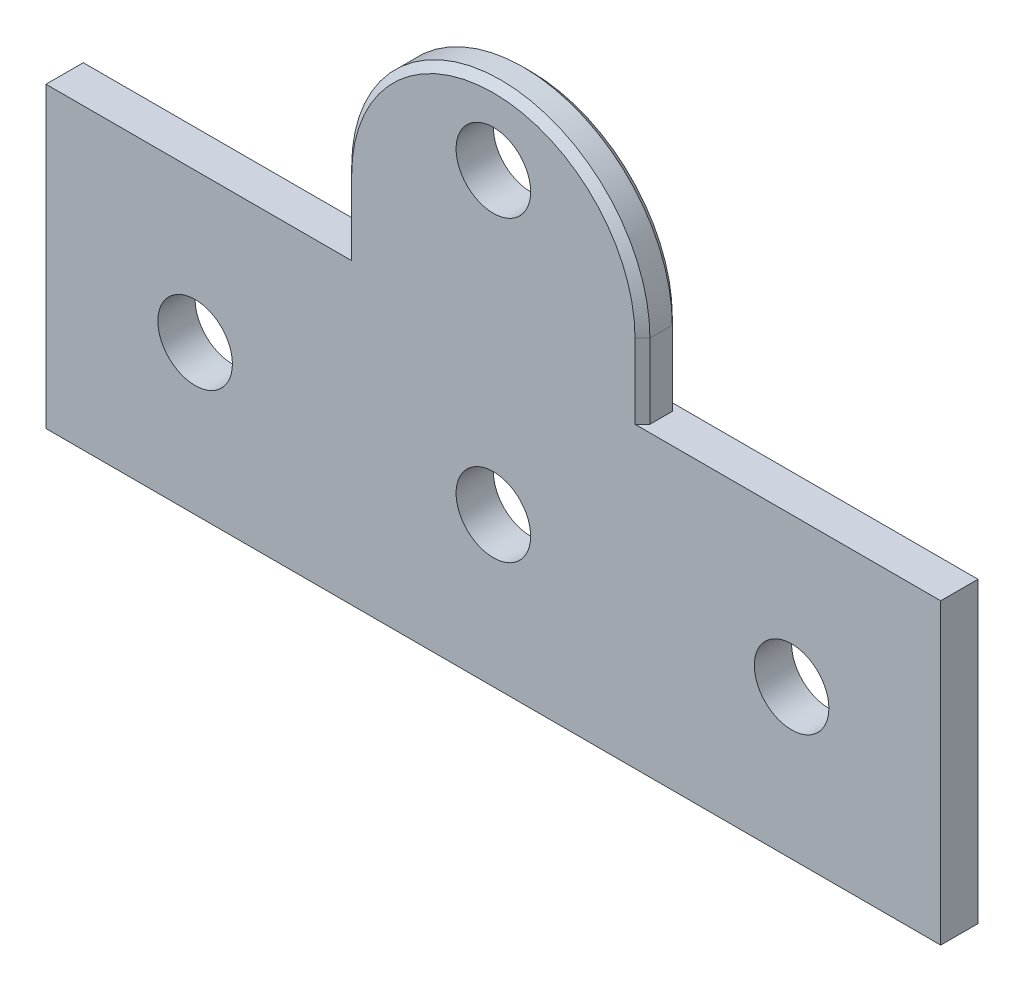
ISO-10303-21;
HEADER;
FILE_DESCRIPTION(('STEP AP214'),'2;1');
FILE_NAME('part.step','',(''),(''),'','','');
FILE_SCHEMA(('AUTOMOTIVE_DESIGN { 1 0 10303 214 1 1 1 1 }'));
ENDSEC;
DATA;
#1=APPLICATION_CONTEXT('core data for automotive mechanical design processes');
#2=APPLICATION_PROTOCOL_DEFINITION('international standard','automotive_design',2000,#1);
#3=PRODUCT_CONTEXT('',#1,'mechanical');
#4=PRODUCT('Part','Part','',(#3));
#5=PRODUCT_RELATED_PRODUCT_CATEGORY('part','',(#4));
#6=PRODUCT_DEFINITION_FORMATION('','',#4);
#7=PRODUCT_DEFINITION_CONTEXT('part definition',#1,'design');
#8=PRODUCT_DEFINITION('design','',#6,#7);
#9=PRODUCT_DEFINITION_SHAPE('','',#8);
#10=(LENGTH_UNIT() NAMED_UNIT(*) SI_UNIT(.MILLI.,.METRE.));
#11=(NAMED_UNIT(*) PLANE_ANGLE_UNIT() SI_UNIT($,.RADIAN.));
#12=(NAMED_UNIT(*) SI_UNIT($,.STERADIAN.) SOLID_ANGLE_UNIT());
#13=UNCERTAINTY_MEASURE_WITH_UNIT(LENGTH_MEASURE(1.E-05),#10,'distance_accuracy_value','');
#14=(GEOMETRIC_REPRESENTATION_CONTEXT(3) GLOBAL_UNCERTAINTY_ASSIGNED_CONTEXT((#13)) GLOBAL_UNIT_ASSIGNED_CONTEXT((#10,
#11,#12)) REPRESENTATION_CONTEXT('',''));
#15=CARTESIAN_POINT('',(0.,0.,0.));
#16=DIRECTION('',(0.,0.,1.));
#17=DIRECTION('',(1.,0.,0.));
#18=AXIS2_PLACEMENT_3D('',#15,#16,#17);
#19=CARTESIAN_POINT('',(12.7,31.75,3.175));
#20=DIRECTION('',(0.,0.,-1.));
#21=DIRECTION('',(-1.,0.,0.));
#22=AXIS2_PLACEMENT_3D('',#19,#20,#21);
#23=PLANE('',#22);
#24=DIRECTION('',(-1.,0.,0.));
#25=VECTOR('',#24,1.);
#26=CARTESIAN_POINT('',(50.8,25.4,3.175));
#27=LINE('',#26,#25);
#28=CARTESIAN_POINT('',(50.8,25.4,3.175));
#29=VERTEX_POINT('',#28);
#30=CARTESIAN_POINT('',(24.765,25.4,3.175));
#31=VERTEX_POINT('',#30);
#32=EDGE_CURVE('E50',#29,#31,#27,.T.);
#33=ORIENTED_EDGE('',*,*,#32,.T.);
#34=DIRECTION('',(0.,1.,0.));
#35=VECTOR('',#34,1.);
#36=CARTESIAN_POINT('',(24.765,31.75,3.175));
#37=LINE('',#36,#35);
#38=CARTESIAN_POINT('',(24.765,31.75,3.175));
#39=VERTEX_POINT('',#38);
#40=EDGE_CURVE('E203',#31,#39,#37,.T.);
#41=ORIENTED_EDGE('',*,*,#40,.T.);
#42=CARTESIAN_POINT('',(12.7,31.75,3.175));
#43=DIRECTION('',(0.,0.,-1.));
#44=DIRECTION('',(-1.,0.,0.));
#45=AXIS2_PLACEMENT_3D('',#42,#43,#44);
#46=CIRCLE('',#45,12.065);
#47=CARTESIAN_POINT('',(0.635000000000018,31.75,3.175));
#48=VERTEX_POINT('',#47);
#49=EDGE_CURVE('E199',#39,#48,#46,.F.);
#50=ORIENTED_EDGE('',*,*,#49,.T.);
#51=DIRECTION('',(0.,-1.,0.));
#52=VECTOR('',#51,1.);
#53=CARTESIAN_POINT('',(0.635000000000018,31.75,3.175));
#54=LINE('',#53,#52);
#55=CARTESIAN_POINT('',(0.635000000000018,25.4,3.175));
#56=VERTEX_POINT('',#55);
#57=EDGE_CURVE('E201',#48,#56,#54,.T.);
#58=ORIENTED_EDGE('',*,*,#57,.T.);
#59=DIRECTION('',(-1.,0.,0.));
#60=VECTOR('',#59,1.);
#61=CARTESIAN_POINT('',(0.,25.4,3.175));
#62=LINE('',#61,#60);
#63=CARTESIAN_POINT('',(-25.4,25.4,3.175));
#64=VERTEX_POINT('',#63);
#65=EDGE_CURVE('E57',#56,#64,#62,.T.);
#66=ORIENTED_EDGE('',*,*,#65,.T.);
#67=DIRECTION('',(0.,-1.,0.));
#68=VECTOR('',#67,1.);
#69=CARTESIAN_POINT('',(-25.4,25.4,3.175));
#70=LINE('',#69,#68);
#71=CARTESIAN_POINT('',(-25.4,0.,3.175));
#72=VERTEX_POINT('',#71);
#73=EDGE_CURVE('E129',#64,#72,#70,.T.);
#74=ORIENTED_EDGE('',*,*,#73,.T.);
#75=DIRECTION('',(1.,0.,0.));
#76=VECTOR('',#75,1.);
#77=CARTESIAN_POINT('',(-25.4,0.,3.175));
#78=LINE('',#77,#76);
#79=CARTESIAN_POINT('',(50.8,0.,3.175));
#80=VERTEX_POINT('',#79);
#81=EDGE_CURVE('E122',#72,#80,#78,.T.);
#82=ORIENTED_EDGE('',*,*,#81,.T.);
#83=DIRECTION('',(0.,1.,0.));
#84=VECTOR('',#83,1.);
#85=CARTESIAN_POINT('',(50.8,0.,3.175));
#86=LINE('',#85,#84);
#87=EDGE_CURVE('E126',#80,#29,#86,.T.);
#88=ORIENTED_EDGE('',*,*,#87,.T.);
#89=EDGE_LOOP('',(#33,#41,#50,#58,#66,#74,#82,#88));
#90=FACE_BOUND('',#89,.T.);
#91=CARTESIAN_POINT('',(12.7,38.1,3.175));
#92=DIRECTION('',(0.,0.,1.));
#93=DIRECTION('',(1.,0.,0.));
#94=AXIS2_PLACEMENT_3D('',#91,#92,#93);
#95=CIRCLE('',#94,3.175);
#96=CARTESIAN_POINT('',(15.875,38.1,3.175));
#97=VERTEX_POINT('',#96);
#98=EDGE_CURVE('E155',#97,#97,#95,.T.);
#99=ORIENTED_EDGE('',*,*,#98,.F.);
#100=EDGE_LOOP('',(#99));
#101=FACE_BOUND('',#100,.T.);
#102=CARTESIAN_POINT('',(12.7,12.7,3.175));
#103=DIRECTION('',(0.,0.,1.));
#104=DIRECTION('',(1.,0.,0.));
#105=AXIS2_PLACEMENT_3D('',#102,#103,#104);
#106=CIRCLE('',#105,3.175);
#107=CARTESIAN_POINT('',(15.875,12.7,3.175));
#108=VERTEX_POINT('',#107);
#109=EDGE_CURVE('E290',#108,#108,#106,.T.);
#110=ORIENTED_EDGE('',*,*,#109,.F.);
#111=EDGE_LOOP('',(#110));
#112=FACE_BOUND('',#111,.T.);
#113=CARTESIAN_POINT('',(38.1,12.7,3.175));
#114=DIRECTION('',(0.,0.,1.));
#115=DIRECTION('',(1.,0.,0.));
#116=AXIS2_PLACEMENT_3D('',#113,#114,#115);
#117=CIRCLE('',#116,3.175);
#118=CARTESIAN_POINT('',(41.275,12.7,3.175));
#119=VERTEX_POINT('',#118);
#120=EDGE_CURVE('E285',#119,#119,#117,.T.);
#121=ORIENTED_EDGE('',*,*,#120,.F.);
#122=EDGE_LOOP('',(#121));
#123=FACE_BOUND('',#122,.T.);
#124=CARTESIAN_POINT('',(-12.7,12.7,3.175));
#125=DIRECTION('',(0.,0.,1.));
#126=DIRECTION('',(1.,0.,0.));
#127=AXIS2_PLACEMENT_3D('',#124,#125,#126);
#128=CIRCLE('',#127,3.175);
#129=CARTESIAN_POINT('',(-9.525,12.7,3.175));
#130=VERTEX_POINT('',#129);
#131=EDGE_CURVE('E279',#130,#130,#128,.T.);
#132=ORIENTED_EDGE('',*,*,#131,.F.);
#133=EDGE_LOOP('',(#132));
#134=FACE_BOUND('',#133,.T.);
#135=ADVANCED_FACE('F33',(#90,#101,#112,#123,#134),#23,.F.);
#136=CARTESIAN_POINT('',(12.7,31.75,0.));
#137=DIRECTION('',(0.,0.,-1.));
#138=DIRECTION('',(-1.,0.,0.));
#139=AXIS2_PLACEMENT_3D('',#136,#137,#138);
#140=PLANE('',#139);
#141=CARTESIAN_POINT('',(38.1,12.7,0.));
#142=DIRECTION('',(0.,0.,1.));
#143=DIRECTION('',(1.,0.,0.));
#144=AXIS2_PLACEMENT_3D('',#141,#142,#143);
#145=CIRCLE('',#144,3.175);
#146=CARTESIAN_POINT('',(41.275,12.7,0.));
#147=VERTEX_POINT('',#146);
#148=EDGE_CURVE('E282',#147,#147,#145,.T.);
#149=ORIENTED_EDGE('',*,*,#148,.T.);
#150=EDGE_LOOP('',(#149));
#151=FACE_BOUND('',#150,.T.);
#152=CARTESIAN_POINT('',(12.7,38.1,0.));
#153=DIRECTION('',(0.,0.,1.));
#154=DIRECTION('',(1.,0.,0.));
#155=AXIS2_PLACEMENT_3D('',#152,#153,#154);
#156=CIRCLE('',#155,3.175);
#157=CARTESIAN_POINT('',(15.875,38.1,0.));
#158=VERTEX_POINT('',#157);
#159=EDGE_CURVE('E293',#158,#158,#156,.T.);
#160=ORIENTED_EDGE('',*,*,#159,.T.);
#161=EDGE_LOOP('',(#160));
#162=FACE_BOUND('',#161,.T.);
#163=DIRECTION('',(0.,-1.,0.));
#164=VECTOR('',#163,1.);
#165=CARTESIAN_POINT('',(24.765,25.4,0.));
#166=LINE('',#165,#164);
#167=CARTESIAN_POINT('',(24.765,31.75,0.));
#168=VERTEX_POINT('',#167);
#169=CARTESIAN_POINT('',(24.765,25.4,0.));
#170=VERTEX_POINT('',#169);
#171=EDGE_CURVE('E188',#168,#170,#166,.T.);
#172=ORIENTED_EDGE('',*,*,#171,.T.);
#173=DIRECTION('',(-1.,0.,0.));
#174=VECTOR('',#173,1.);
#175=CARTESIAN_POINT('',(50.8,25.4,0.));
#176=LINE('',#175,#174);
#177=CARTESIAN_POINT('',(50.8,25.4,0.));
#178=VERTEX_POINT('',#177);
#179=EDGE_CURVE('E157',#178,#170,#176,.T.);
#180=ORIENTED_EDGE('',*,*,#179,.F.);
#181=DIRECTION('',(0.,1.,0.));
#182=VECTOR('',#181,1.);
#183=CARTESIAN_POINT('',(50.8,0.,0.));
#184=LINE('',#183,#182);
#185=CARTESIAN_POINT('',(50.8,0.,0.));
#186=VERTEX_POINT('',#185);
#187=EDGE_CURVE('E154',#186,#178,#184,.T.);
#188=ORIENTED_EDGE('',*,*,#187,.F.);
#189=DIRECTION('',(1.,0.,0.));
#190=VECTOR('',#189,1.);
#191=CARTESIAN_POINT('',(25.4,0.,0.));
#192=LINE('',#191,#190);
#193=CARTESIAN_POINT('',(-25.4,0.,0.));
#194=VERTEX_POINT('',#193);
#195=EDGE_CURVE('E138',#194,#186,#192,.T.);
#196=ORIENTED_EDGE('',*,*,#195,.F.);
#197=DIRECTION('',(0.,-1.,0.));
#198=VECTOR('',#197,1.);
#199=CARTESIAN_POINT('',(-25.4,25.4,0.));
#200=LINE('',#199,#198);
#201=CARTESIAN_POINT('',(-25.4,25.4,0.));
#202=VERTEX_POINT('',#201);
#203=EDGE_CURVE('E133',#202,#194,#200,.T.);
#204=ORIENTED_EDGE('',*,*,#203,.F.);
#205=DIRECTION('',(-1.,0.,0.));
#206=VECTOR('',#205,1.);
#207=CARTESIAN_POINT('',(0.,25.4,0.));
#208=LINE('',#207,#206);
#209=CARTESIAN_POINT('',(0.635000000000004,25.4,0.));
#210=VERTEX_POINT('',#209);
#211=EDGE_CURVE('E159',#210,#202,#208,.T.);
#212=ORIENTED_EDGE('',*,*,#211,.F.);
#213=DIRECTION('',(0.,1.,0.));
#214=VECTOR('',#213,1.);
#215=CARTESIAN_POINT('',(0.635000000000004,31.75,0.));
#216=LINE('',#215,#214);
#217=CARTESIAN_POINT('',(0.635000000000004,31.75,0.));
#218=VERTEX_POINT('',#217);
#219=EDGE_CURVE('E186',#210,#218,#216,.T.);
#220=ORIENTED_EDGE('',*,*,#219,.T.);
#221=CARTESIAN_POINT('',(12.7,31.75,0.));
#222=DIRECTION('',(0.,0.,-1.));
#223=DIRECTION('',(-1.,0.,0.));
#224=AXIS2_PLACEMENT_3D('',#221,#222,#223);
#225=CIRCLE('',#224,12.065);
#226=EDGE_CURVE('E184',#218,#168,#225,.T.);
#227=ORIENTED_EDGE('',*,*,#226,.T.);
#228=EDGE_LOOP('',(#172,#180,#188,#196,#204,#212,#220,#227));
#229=FACE_BOUND('',#228,.T.);
#230=CARTESIAN_POINT('',(12.7,12.7,0.));
#231=DIRECTION('',(0.,0.,1.));
#232=DIRECTION('',(1.,0.,0.));
#233=AXIS2_PLACEMENT_3D('',#230,#231,#232);
#234=CIRCLE('',#233,3.175);
#235=CARTESIAN_POINT('',(15.875,12.7,0.));
#236=VERTEX_POINT('',#235);
#237=EDGE_CURVE('E275',#236,#236,#234,.T.);
#238=ORIENTED_EDGE('',*,*,#237,.T.);
#239=EDGE_LOOP('',(#238));
#240=FACE_BOUND('',#239,.T.);
#241=CARTESIAN_POINT('',(-12.7,12.7,0.));
#242=DIRECTION('',(0.,0.,1.));
#243=DIRECTION('',(1.,0.,0.));
#244=AXIS2_PLACEMENT_3D('',#241,#242,#243);
#245=CIRCLE('',#244,3.175);
#246=CARTESIAN_POINT('',(-9.525,12.7,0.));
#247=VERTEX_POINT('',#246);
#248=EDGE_CURVE('E215',#247,#247,#245,.T.);
#249=ORIENTED_EDGE('',*,*,#248,.T.);
#250=EDGE_LOOP('',(#249));
#251=FACE_BOUND('',#250,.T.);
#252=ADVANCED_FACE('F266',(#151,#162,#229,#240,#251),#140,.T.);
#253=CARTESIAN_POINT('',(25.4,0.,3.175));
#254=DIRECTION('',(0.,1.,0.));
#255=DIRECTION('',(0.,0.,1.));
#256=AXIS2_PLACEMENT_3D('',#253,#254,#255);
#257=PLANE('',#256);
#258=ORIENTED_EDGE('',*,*,#195,.T.);
#259=DIRECTION('',(0.,0.,-1.));
#260=VECTOR('',#259,1.);
#261=CARTESIAN_POINT('',(50.8,0.,3.175));
#262=LINE('',#261,#260);
#263=EDGE_CURVE('E136',#80,#186,#262,.T.);
#264=ORIENTED_EDGE('',*,*,#263,.F.);
#265=ORIENTED_EDGE('',*,*,#81,.F.);
#266=DIRECTION('',(0.,0.,-1.));
#267=VECTOR('',#266,1.);
#268=CARTESIAN_POINT('',(-25.4,0.,3.175));
#269=LINE('',#268,#267);
#270=EDGE_CURVE('E152',#72,#194,#269,.T.);
#271=ORIENTED_EDGE('',*,*,#270,.T.);
#272=EDGE_LOOP('',(#258,#264,#265,#271));
#273=FACE_BOUND('',#272,.T.);
#274=ADVANCED_FACE('F137',(#273),#257,.F.);
#275=CARTESIAN_POINT('',(50.8,0.,3.175));
#276=DIRECTION('',(-1.,0.,0.));
#277=DIRECTION('',(0.,0.,1.));
#278=AXIS2_PLACEMENT_3D('',#275,#276,#277);
#279=PLANE('',#278);
#280=ORIENTED_EDGE('',*,*,#187,.T.);
#281=DIRECTION('',(0.,0.,-1.));
#282=VECTOR('',#281,1.);
#283=CARTESIAN_POINT('',(50.8,25.4,3.175));
#284=LINE('',#283,#282);
#285=EDGE_CURVE('E142',#29,#178,#284,.T.);
#286=ORIENTED_EDGE('',*,*,#285,.F.);
#287=ORIENTED_EDGE('',*,*,#87,.F.);
#288=ORIENTED_EDGE('',*,*,#263,.T.);
#289=EDGE_LOOP('',(#280,#286,#287,#288));
#290=FACE_BOUND('',#289,.T.);
#291=ADVANCED_FACE('F144',(#290),#279,.F.);
#292=CARTESIAN_POINT('',(50.8,25.4,3.175));
#293=DIRECTION('',(0.,-1.,0.));
#294=DIRECTION('',(0.,0.,-1.));
#295=AXIS2_PLACEMENT_3D('',#292,#293,#294);
#296=PLANE('',#295);
#297=ORIENTED_EDGE('',*,*,#179,.T.);
#298=DIRECTION('',(0.707106781186549,0.,0.707106781186547));
#299=VECTOR('',#298,1.);
#300=CARTESIAN_POINT('',(39.37,25.4,14.605));
#301=LINE('',#300,#299);
#302=CARTESIAN_POINT('',(25.4,25.4,0.635000000000002));
#303=VERTEX_POINT('',#302);
#304=EDGE_CURVE('E205',#170,#303,#301,.T.);
#305=ORIENTED_EDGE('',*,*,#304,.T.);
#306=DIRECTION('',(0.,0.,-1.));
#307=VECTOR('',#306,1.);
#308=CARTESIAN_POINT('',(25.4,25.4,3.175));
#309=LINE('',#308,#307);
#310=CARTESIAN_POINT('',(25.4,25.4,2.54));
#311=VERTEX_POINT('',#310);
#312=EDGE_CURVE('E176',#311,#303,#309,.T.);
#313=ORIENTED_EDGE('',*,*,#312,.F.);
#314=DIRECTION('',(0.707106781186556,0.,-0.707106781186539));
#315=VECTOR('',#314,1.);
#316=CARTESIAN_POINT('',(37.7825000000003,25.4,-9.84250000000001));
#317=LINE('',#316,#315);
#318=EDGE_CURVE('E42',#311,#31,#317,.F.);
#319=ORIENTED_EDGE('',*,*,#318,.T.);
#320=ORIENTED_EDGE('',*,*,#32,.F.);
#321=ORIENTED_EDGE('',*,*,#285,.T.);
#322=EDGE_LOOP('',(#297,#305,#313,#319,#320,#321));
#323=FACE_BOUND('',#322,.T.);
#324=ADVANCED_FACE('F235',(#323),#296,.F.);
#325=CARTESIAN_POINT('',(25.4,31.75,3.175));
#326=DIRECTION('',(-1.,0.,0.));
#327=DIRECTION('',(0.,-1.,0.));
#328=AXIS2_PLACEMENT_3D('',#325,#326,#327);
#329=PLANE('',#328);
#330=ORIENTED_EDGE('',*,*,#312,.T.);
#331=DIRECTION('',(0.,1.,0.));
#332=VECTOR('',#331,1.);
#333=CARTESIAN_POINT('',(25.4,31.75,0.635000000000002));
#334=LINE('',#333,#332);
#335=CARTESIAN_POINT('',(25.4,31.75,0.635000000000002));
#336=VERTEX_POINT('',#335);
#337=EDGE_CURVE('E181',#303,#336,#334,.T.);
#338=ORIENTED_EDGE('',*,*,#337,.T.);
#339=DIRECTION('',(0.,0.,-1.));
#340=VECTOR('',#339,1.);
#341=CARTESIAN_POINT('',(25.4,31.75,3.175));
#342=LINE('',#341,#340);
#343=CARTESIAN_POINT('',(25.4,31.75,2.54));
#344=VERTEX_POINT('',#343);
#345=EDGE_CURVE('E173',#344,#336,#342,.T.);
#346=ORIENTED_EDGE('',*,*,#345,.F.);
#347=DIRECTION('',(0.,-1.,0.));
#348=VECTOR('',#347,1.);
#349=CARTESIAN_POINT('',(25.4,31.75,2.54));
#350=LINE('',#349,#348);
#351=EDGE_CURVE('E141',#344,#311,#350,.T.);
#352=ORIENTED_EDGE('',*,*,#351,.T.);
#353=EDGE_LOOP('',(#330,#338,#346,#352));
#354=FACE_BOUND('',#353,.T.);
#355=ADVANCED_FACE('F239',(#354),#329,.F.);
#356=CARTESIAN_POINT('',(12.7,31.75,3.175));
#357=DIRECTION('',(0.,0.,-1.));
#358=DIRECTION('',(-1.,0.,0.));
#359=AXIS2_PLACEMENT_3D('',#356,#357,#358);
#360=CYLINDRICAL_SURFACE('',#359,12.7);
#361=ORIENTED_EDGE('',*,*,#345,.T.);
#362=CARTESIAN_POINT('',(12.7,31.75,0.635000000000002));
#363=DIRECTION('',(0.,0.,-1.));
#364=DIRECTION('',(-1.,0.,0.));
#365=AXIS2_PLACEMENT_3D('',#362,#363,#364);
#366=CIRCLE('',#365,12.7);
#367=CARTESIAN_POINT('',(0.,31.75,0.635000000000002));
#368=VERTEX_POINT('',#367);
#369=EDGE_CURVE('E197',#336,#368,#366,.F.);
#370=ORIENTED_EDGE('',*,*,#369,.T.);
#371=DIRECTION('',(0.,0.,-1.));
#372=VECTOR('',#371,1.);
#373=CARTESIAN_POINT('',(0.,31.75,3.175));
#374=LINE('',#373,#372);
#375=CARTESIAN_POINT('',(0.,31.75,2.54));
#376=VERTEX_POINT('',#375);
#377=EDGE_CURVE('E170',#376,#368,#374,.T.);
#378=ORIENTED_EDGE('',*,*,#377,.F.);
#379=CARTESIAN_POINT('',(12.7,31.75,2.54));
#380=DIRECTION('',(0.,0.,-1.));
#381=DIRECTION('',(-1.,0.,0.));
#382=AXIS2_PLACEMENT_3D('',#379,#380,#381);
#383=CIRCLE('',#382,12.7);
#384=EDGE_CURVE('E195',#376,#344,#383,.T.);
#385=ORIENTED_EDGE('',*,*,#384,.T.);
#386=EDGE_LOOP('',(#361,#370,#378,#385));
#387=FACE_BOUND('',#386,.T.);
#388=ADVANCED_FACE('F252',(#387),#360,.T.);
#389=CARTESIAN_POINT('',(0.,25.4,3.175));
#390=DIRECTION('',(1.,0.,0.));
#391=DIRECTION('',(0.,0.,-1.));
#392=AXIS2_PLACEMENT_3D('',#389,#390,#391);
#393=PLANE('',#392);
#394=ORIENTED_EDGE('',*,*,#377,.T.);
#395=DIRECTION('',(0.,-1.,0.));
#396=VECTOR('',#395,1.);
#397=CARTESIAN_POINT('',(0.,25.4,0.635000000000002));
#398=LINE('',#397,#396);
#399=CARTESIAN_POINT('',(0.,25.4,0.635000000000002));
#400=VERTEX_POINT('',#399);
#401=EDGE_CURVE('E193',#368,#400,#398,.T.);
#402=ORIENTED_EDGE('',*,*,#401,.T.);
#403=DIRECTION('',(0.,0.,-1.));
#404=VECTOR('',#403,1.);
#405=CARTESIAN_POINT('',(0.,25.4,3.175));
#406=LINE('',#405,#404);
#407=CARTESIAN_POINT('',(0.,25.4,2.54));
#408=VERTEX_POINT('',#407);
#409=EDGE_CURVE('E167',#408,#400,#406,.T.);
#410=ORIENTED_EDGE('',*,*,#409,.F.);
#411=DIRECTION('',(0.,1.,0.));
#412=VECTOR('',#411,1.);
#413=CARTESIAN_POINT('',(0.,25.4,2.54));
#414=LINE('',#413,#412);
#415=EDGE_CURVE('E191',#408,#376,#414,.T.);
#416=ORIENTED_EDGE('',*,*,#415,.T.);
#417=EDGE_LOOP('',(#394,#402,#410,#416));
#418=FACE_BOUND('',#417,.T.);
#419=ADVANCED_FACE('F255',(#418),#393,.F.);
#420=CARTESIAN_POINT('',(0.,25.4,3.175));
#421=DIRECTION('',(0.,-1.,0.));
#422=DIRECTION('',(0.,0.,-1.));
#423=AXIS2_PLACEMENT_3D('',#420,#421,#422);
#424=PLANE('',#423);
#425=ORIENTED_EDGE('',*,*,#211,.T.);
#426=DIRECTION('',(0.,0.,-1.));
#427=VECTOR('',#426,1.);
#428=CARTESIAN_POINT('',(-25.4,25.4,3.175));
#429=LINE('',#428,#427);
#430=EDGE_CURVE('E164',#64,#202,#429,.T.);
#431=ORIENTED_EDGE('',*,*,#430,.F.);
#432=ORIENTED_EDGE('',*,*,#65,.F.);
#433=DIRECTION('',(0.707106781186556,0.,0.707106781186539));
#434=VECTOR('',#433,1.);
#435=CARTESIAN_POINT('',(0.317500000000001,25.4,2.85749999999999));
#436=LINE('',#435,#434);
#437=EDGE_CURVE('E11',#56,#408,#436,.F.);
#438=ORIENTED_EDGE('',*,*,#437,.T.);
#439=ORIENTED_EDGE('',*,*,#409,.T.);
#440=DIRECTION('',(0.707106781186549,0.,-0.707106781186547));
#441=VECTOR('',#440,1.);
#442=CARTESIAN_POINT('',(-1.27,25.4,1.905));
#443=LINE('',#442,#441);
#444=EDGE_CURVE('E207',#400,#210,#443,.T.);
#445=ORIENTED_EDGE('',*,*,#444,.T.);
#446=EDGE_LOOP('',(#425,#431,#432,#438,#439,#445));
#447=FACE_BOUND('',#446,.T.);
#448=ADVANCED_FACE('F261',(#447),#424,.F.);
#449=CARTESIAN_POINT('',(-25.4,25.4,3.175));
#450=DIRECTION('',(1.,0.,0.));
#451=DIRECTION('',(0.,0.,-1.));
#452=AXIS2_PLACEMENT_3D('',#449,#450,#451);
#453=PLANE('',#452);
#454=ORIENTED_EDGE('',*,*,#203,.T.);
#455=ORIENTED_EDGE('',*,*,#270,.F.);
#456=ORIENTED_EDGE('',*,*,#73,.F.);
#457=ORIENTED_EDGE('',*,*,#430,.T.);
#458=EDGE_LOOP('',(#454,#455,#456,#457));
#459=FACE_BOUND('',#458,.T.);
#460=ADVANCED_FACE('F265',(#459),#453,.F.);
#461=CARTESIAN_POINT('',(12.7,38.1,3.175));
#462=DIRECTION('',(0.,0.,-1.));
#463=DIRECTION('',(-1.,0.,0.));
#464=AXIS2_PLACEMENT_3D('',#461,#462,#463);
#465=CYLINDRICAL_SURFACE('',#464,3.175);
#466=ORIENTED_EDGE('',*,*,#98,.T.);
#467=EDGE_LOOP('',(#466));
#468=FACE_BOUND('',#467,.T.);
#469=ORIENTED_EDGE('',*,*,#159,.F.);
#470=EDGE_LOOP('',(#469));
#471=FACE_BOUND('',#470,.T.);
#472=ADVANCED_FACE('F300',(#468,#471),#465,.F.);
#473=CARTESIAN_POINT('',(12.7,12.7,3.175));
#474=DIRECTION('',(0.,0.,-1.));
#475=DIRECTION('',(-1.,0.,0.));
#476=AXIS2_PLACEMENT_3D('',#473,#474,#475);
#477=CYLINDRICAL_SURFACE('',#476,3.175);
#478=ORIENTED_EDGE('',*,*,#109,.T.);
#479=EDGE_LOOP('',(#478));
#480=FACE_BOUND('',#479,.T.);
#481=ORIENTED_EDGE('',*,*,#237,.F.);
#482=EDGE_LOOP('',(#481));
#483=FACE_BOUND('',#482,.T.);
#484=ADVANCED_FACE('F302',(#480,#483),#477,.F.);
#485=CARTESIAN_POINT('',(38.1,12.7,3.175));
#486=DIRECTION('',(0.,0.,-1.));
#487=DIRECTION('',(-1.,0.,0.));
#488=AXIS2_PLACEMENT_3D('',#485,#486,#487);
#489=CYLINDRICAL_SURFACE('',#488,3.175);
#490=ORIENTED_EDGE('',*,*,#120,.T.);
#491=EDGE_LOOP('',(#490));
#492=FACE_BOUND('',#491,.T.);
#493=ORIENTED_EDGE('',*,*,#148,.F.);
#494=EDGE_LOOP('',(#493));
#495=FACE_BOUND('',#494,.T.);
#496=ADVANCED_FACE('F309',(#492,#495),#489,.F.);
#497=CARTESIAN_POINT('',(-12.7,12.7,3.175));
#498=DIRECTION('',(0.,0.,-1.));
#499=DIRECTION('',(-1.,0.,0.));
#500=AXIS2_PLACEMENT_3D('',#497,#498,#499);
#501=CYLINDRICAL_SURFACE('',#500,3.175);
#502=ORIENTED_EDGE('',*,*,#131,.T.);
#503=EDGE_LOOP('',(#502));
#504=FACE_BOUND('',#503,.T.);
#505=ORIENTED_EDGE('',*,*,#248,.F.);
#506=EDGE_LOOP('',(#505));
#507=FACE_BOUND('',#506,.T.);
#508=ADVANCED_FACE('F338',(#504,#507),#501,.F.);
#509=CARTESIAN_POINT('',(0.,25.4,0.635000000000002));
#510=DIRECTION('',(-0.707106781186547,0.,-0.707106781186549));
#511=DIRECTION('',(0.,1.,0.));
#512=AXIS2_PLACEMENT_3D('',#509,#510,#511);
#513=PLANE('',#512);
#514=ORIENTED_EDGE('',*,*,#444,.F.);
#515=ORIENTED_EDGE('',*,*,#401,.F.);
#516=DIRECTION('',(-0.707106781186549,0.,0.707106781186547));
#517=VECTOR('',#516,1.);
#518=CARTESIAN_POINT('',(0.635000000000004,31.75,0.));
#519=LINE('',#518,#517);
#520=EDGE_CURVE('E213',#218,#368,#519,.T.);
#521=ORIENTED_EDGE('',*,*,#520,.F.);
#522=ORIENTED_EDGE('',*,*,#219,.F.);
#523=EDGE_LOOP('',(#514,#515,#521,#522));
#524=FACE_BOUND('',#523,.T.);
#525=ADVANCED_FACE('F259',(#524),#513,.T.);
#526=CARTESIAN_POINT('',(12.7,31.75,0.635000000000002));
#527=DIRECTION('',(0.,0.,1.));
#528=DIRECTION('',(1.,0.,0.));
#529=AXIS2_PLACEMENT_3D('',#526,#527,#528);
#530=CONICAL_SURFACE('',#529,12.7,0.78539816339745);
#531=ORIENTED_EDGE('',*,*,#520,.T.);
#532=ORIENTED_EDGE('',*,*,#369,.F.);
#533=DIRECTION('',(0.707106781186549,0.,0.707106781186547));
#534=VECTOR('',#533,1.);
#535=CARTESIAN_POINT('',(24.765,31.75,0.));
#536=LINE('',#535,#534);
#537=EDGE_CURVE('E211',#168,#336,#536,.T.);
#538=ORIENTED_EDGE('',*,*,#537,.F.);
#539=ORIENTED_EDGE('',*,*,#226,.F.);
#540=EDGE_LOOP('',(#531,#532,#538,#539));
#541=FACE_BOUND('',#540,.T.);
#542=ADVANCED_FACE('F248',(#541),#530,.T.);
#543=CARTESIAN_POINT('',(25.4,31.75,0.635000000000002));
#544=DIRECTION('',(0.707106781186547,0.,-0.707106781186549));
#545=DIRECTION('',(0.,-1.,0.));
#546=AXIS2_PLACEMENT_3D('',#543,#544,#545);
#547=PLANE('',#546);
#548=ORIENTED_EDGE('',*,*,#304,.F.);
#549=ORIENTED_EDGE('',*,*,#171,.F.);
#550=ORIENTED_EDGE('',*,*,#537,.T.);
#551=ORIENTED_EDGE('',*,*,#337,.F.);
#552=EDGE_LOOP('',(#548,#549,#550,#551));
#553=FACE_BOUND('',#552,.T.);
#554=ADVANCED_FACE('F242',(#553),#547,.T.);
#555=CARTESIAN_POINT('',(0.635000000000018,31.75,3.175));
#556=DIRECTION('',(0.707106781186539,0.,-0.707106781186556));
#557=DIRECTION('',(0.,-1.,0.));
#558=AXIS2_PLACEMENT_3D('',#555,#556,#557);
#559=PLANE('',#558);
#560=ORIENTED_EDGE('',*,*,#437,.F.);
#561=ORIENTED_EDGE('',*,*,#57,.F.);
#562=DIRECTION('',(0.707106781186556,0.,0.707106781186539));
#563=VECTOR('',#562,1.);
#564=CARTESIAN_POINT('',(0.,31.75,2.54));
#565=LINE('',#564,#563);
#566=EDGE_CURVE('E37',#376,#48,#565,.T.);
#567=ORIENTED_EDGE('',*,*,#566,.F.);
#568=ORIENTED_EDGE('',*,*,#415,.F.);
#569=EDGE_LOOP('',(#560,#561,#567,#568));
#570=FACE_BOUND('',#569,.T.);
#571=ADVANCED_FACE('F35',(#570),#559,.F.);
#572=CARTESIAN_POINT('',(12.7,31.75,3.175));
#573=DIRECTION('',(0.,0.,-1.));
#574=DIRECTION('',(-1.,0.,0.));
#575=AXIS2_PLACEMENT_3D('',#572,#573,#574);
#576=CONICAL_SURFACE('',#575,12.065,0.785398163397461);
#577=ORIENTED_EDGE('',*,*,#566,.T.);
#578=ORIENTED_EDGE('',*,*,#49,.F.);
#579=DIRECTION('',(-0.707106781186556,0.,0.707106781186539));
#580=VECTOR('',#579,1.);
#581=CARTESIAN_POINT('',(25.4,31.75,2.54));
#582=LINE('',#581,#580);
#583=EDGE_CURVE('E216',#344,#39,#582,.T.);
#584=ORIENTED_EDGE('',*,*,#583,.F.);
#585=ORIENTED_EDGE('',*,*,#384,.F.);
#586=EDGE_LOOP('',(#577,#578,#584,#585));
#587=FACE_BOUND('',#586,.T.);
#588=ADVANCED_FACE('F226',(#587),#576,.T.);
#589=CARTESIAN_POINT('',(24.765,31.75,3.175));
#590=DIRECTION('',(-0.707106781186539,0.,-0.707106781186556));
#591=DIRECTION('',(0.,1.,0.));
#592=AXIS2_PLACEMENT_3D('',#589,#590,#591);
#593=PLANE('',#592);
#594=ORIENTED_EDGE('',*,*,#318,.F.);
#595=ORIENTED_EDGE('',*,*,#351,.F.);
#596=ORIENTED_EDGE('',*,*,#583,.T.);
#597=ORIENTED_EDGE('',*,*,#40,.F.);
#598=EDGE_LOOP('',(#594,#595,#596,#597));
#599=FACE_BOUND('',#598,.T.);
#600=ADVANCED_FACE('F232',(#599),#593,.F.);
#601=CLOSED_SHELL('',(#135,#252,#274,#291,#324,#355,#388,#419,#448,#460,#472,#484,#496,#508,
#525,#542,#554,#571,#588,#600));
#602=MANIFOLD_SOLID_BREP('B2',#601);
#603=ADVANCED_BREP_SHAPE_REPRESENTATION('',(#18,#602),#14);
#604=SHAPE_DEFINITION_REPRESENTATION(#9,#603);
ENDSEC;
END-ISO-10303-21;
